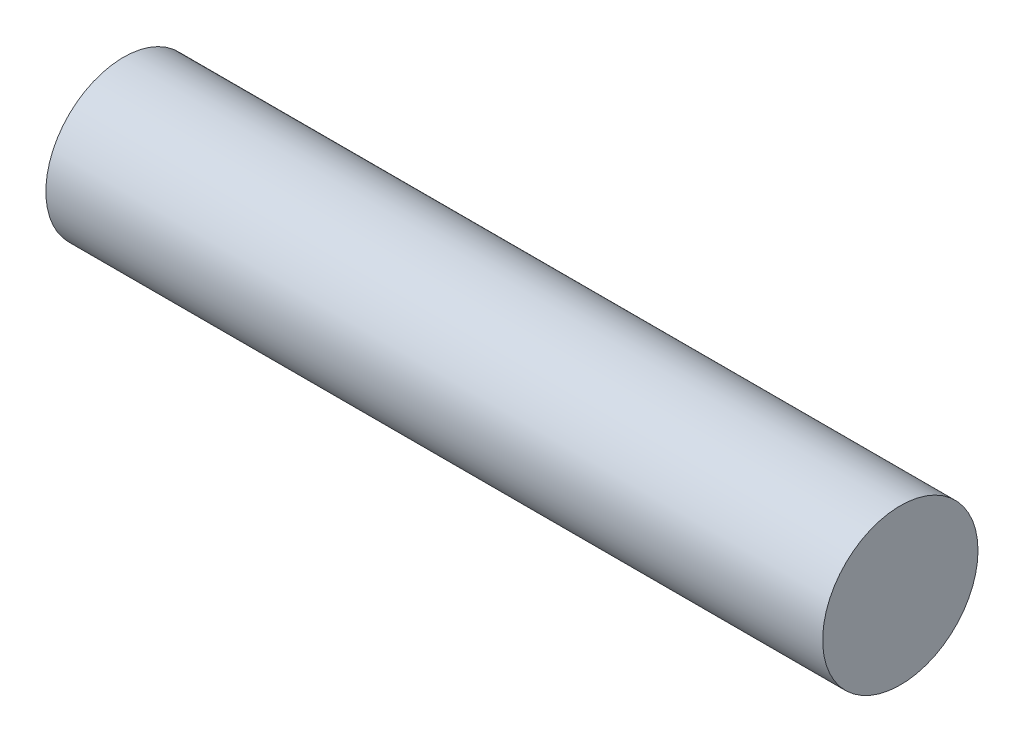
ISO-10303-21;
HEADER;
FILE_DESCRIPTION(('STEP AP214'),'2;1');
FILE_NAME('part.step','',(''),(''),'','','');
FILE_SCHEMA(('AUTOMOTIVE_DESIGN { 1 0 10303 214 1 1 1 1 }'));
ENDSEC;
DATA;
#1=APPLICATION_CONTEXT('core data for automotive mechanical design processes');
#2=APPLICATION_PROTOCOL_DEFINITION('international standard','automotive_design',2000,#1);
#3=PRODUCT_CONTEXT('',#1,'mechanical');
#4=PRODUCT('Part','Part','',(#3));
#5=PRODUCT_RELATED_PRODUCT_CATEGORY('part','',(#4));
#6=PRODUCT_DEFINITION_FORMATION('','',#4);
#7=PRODUCT_DEFINITION_CONTEXT('part definition',#1,'design');
#8=PRODUCT_DEFINITION('design','',#6,#7);
#9=PRODUCT_DEFINITION_SHAPE('','',#8);
#10=(LENGTH_UNIT() NAMED_UNIT(*) SI_UNIT(.MILLI.,.METRE.));
#11=(NAMED_UNIT(*) PLANE_ANGLE_UNIT() SI_UNIT($,.RADIAN.));
#12=(NAMED_UNIT(*) SI_UNIT($,.STERADIAN.) SOLID_ANGLE_UNIT());
#13=UNCERTAINTY_MEASURE_WITH_UNIT(LENGTH_MEASURE(1.E-05),#10,'distance_accuracy_value','');
#14=(GEOMETRIC_REPRESENTATION_CONTEXT(3) GLOBAL_UNCERTAINTY_ASSIGNED_CONTEXT((#13)) GLOBAL_UNIT_ASSIGNED_CONTEXT((#10,
#11,#12)) REPRESENTATION_CONTEXT('',''));
#15=CARTESIAN_POINT('',(0.,0.,0.));
#16=DIRECTION('',(0.,0.,1.));
#17=DIRECTION('',(1.,0.,0.));
#18=AXIS2_PLACEMENT_3D('',#15,#16,#17);
#19=CARTESIAN_POINT('',(30.,0.,0.));
#20=DIRECTION('',(-1.,0.,0.));
#21=DIRECTION('',(0.,0.,1.));
#22=AXIS2_PLACEMENT_3D('',#19,#20,#21);
#23=CYLINDRICAL_SURFACE('',#22,3.);
#24=CARTESIAN_POINT('',(30.,0.,0.));
#25=DIRECTION('',(1.,0.,0.));
#26=DIRECTION('',(0.,0.,-1.));
#27=AXIS2_PLACEMENT_3D('',#24,#25,#26);
#28=CIRCLE('',#27,3.);
#29=CARTESIAN_POINT('',(30.,0.,-3.));
#30=VERTEX_POINT('',#29);
#31=EDGE_CURVE('E10',#30,#30,#28,.T.);
#32=ORIENTED_EDGE('',*,*,#31,.F.);
#33=EDGE_LOOP('',(#32));
#34=FACE_BOUND('',#33,.T.);
#35=CARTESIAN_POINT('',(0.,0.,0.));
#36=DIRECTION('',(1.,0.,0.));
#37=DIRECTION('',(0.,0.,-1.));
#38=AXIS2_PLACEMENT_3D('',#35,#36,#37);
#39=CIRCLE('',#38,3.);
#40=CARTESIAN_POINT('',(0.,0.,-3.));
#41=VERTEX_POINT('',#40);
#42=EDGE_CURVE('E46',#41,#41,#39,.T.);
#43=ORIENTED_EDGE('',*,*,#42,.T.);
#44=EDGE_LOOP('',(#43));
#45=FACE_BOUND('',#44,.T.);
#46=ADVANCED_FACE('F43',(#34,#45),#23,.T.);
#47=CARTESIAN_POINT('',(30.,0.,0.));
#48=DIRECTION('',(1.,0.,0.));
#49=DIRECTION('',(0.,0.,-1.));
#50=AXIS2_PLACEMENT_3D('',#47,#48,#49);
#51=PLANE('',#50);
#52=ORIENTED_EDGE('',*,*,#31,.T.);
#53=EDGE_LOOP('',(#52));
#54=FACE_BOUND('',#53,.T.);
#55=ADVANCED_FACE('F60',(#54),#51,.T.);
#56=CARTESIAN_POINT('',(0.,0.,0.));
#57=DIRECTION('',(1.,0.,0.));
#58=DIRECTION('',(0.,0.,-1.));
#59=AXIS2_PLACEMENT_3D('',#56,#57,#58);
#60=PLANE('',#59);
#61=ORIENTED_EDGE('',*,*,#42,.F.);
#62=EDGE_LOOP('',(#61));
#63=FACE_BOUND('',#62,.T.);
#64=ADVANCED_FACE('F58',(#63),#60,.F.);
#65=CLOSED_SHELL('',(#46,#55,#64));
#66=MANIFOLD_SOLID_BREP('B2',#65);
#67=ADVANCED_BREP_SHAPE_REPRESENTATION('',(#18,#66),#14);
#68=SHAPE_DEFINITION_REPRESENTATION(#9,#67);
ENDSEC;
END-ISO-10303-21;
